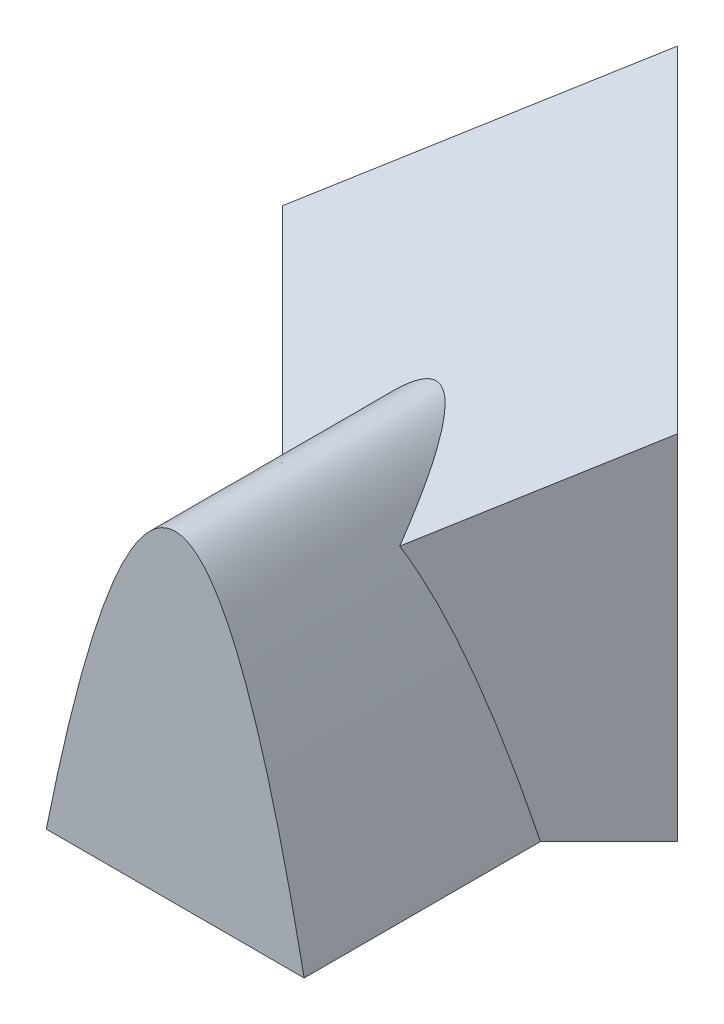
ISO-10303-21;
HEADER;
FILE_DESCRIPTION(('STEP AP214'),'2;1');
FILE_NAME('part.step','',(''),(''),'','','');
FILE_SCHEMA(('AUTOMOTIVE_DESIGN { 1 0 10303 214 1 1 1 1 }'));
ENDSEC;
DATA;
#1=APPLICATION_CONTEXT('core data for automotive mechanical design processes');
#2=APPLICATION_PROTOCOL_DEFINITION('international standard','automotive_design',2000,#1);
#3=PRODUCT_CONTEXT('',#1,'mechanical');
#4=PRODUCT('Part','Part','',(#3));
#5=PRODUCT_RELATED_PRODUCT_CATEGORY('part','',(#4));
#6=PRODUCT_DEFINITION_FORMATION('','',#4);
#7=PRODUCT_DEFINITION_CONTEXT('part definition',#1,'design');
#8=PRODUCT_DEFINITION('design','',#6,#7);
#9=PRODUCT_DEFINITION_SHAPE('','',#8);
#10=(LENGTH_UNIT() NAMED_UNIT(*) SI_UNIT(.MILLI.,.METRE.));
#11=(NAMED_UNIT(*) PLANE_ANGLE_UNIT() SI_UNIT($,.RADIAN.));
#12=(NAMED_UNIT(*) SI_UNIT($,.STERADIAN.) SOLID_ANGLE_UNIT());
#13=UNCERTAINTY_MEASURE_WITH_UNIT(LENGTH_MEASURE(1.E-05),#10,'distance_accuracy_value','');
#14=(GEOMETRIC_REPRESENTATION_CONTEXT(3) GLOBAL_UNCERTAINTY_ASSIGNED_CONTEXT((#13)) GLOBAL_UNIT_ASSIGNED_CONTEXT((#10,
#11,#12)) REPRESENTATION_CONTEXT('',''));
#15=CARTESIAN_POINT('',(0.,0.,0.));
#16=DIRECTION('',(0.,0.,1.));
#17=DIRECTION('',(1.,0.,0.));
#18=AXIS2_PLACEMENT_3D('',#15,#16,#17);
#19=CARTESIAN_POINT('',(-91.9238815542511,228.73,-91.923881554251));
#20=DIRECTION('',(0.707106781186547,0.,-0.707106781186548));
#21=DIRECTION('',(-0.707106781186548,0.,-0.707106781186547));
#22=AXIS2_PLACEMENT_3D('',#19,#20,#21);
#23=PLANE('',#22);
#24=CARTESIAN_POINT('',(0.,149.999999999999,0.));
#25=CARTESIAN_POINT('',(-0.165044397724254,150.00000226675,-0.165044397724277));
#26=CARTESIAN_POINT('',(-0.3300791985032,149.996594514592,-0.330079198503224));
#27=CARTESIAN_POINT('',(-0.660006230604019,149.982983211314,-0.660006230604038));
#28=CARTESIAN_POINT('',(-0.824898464007725,149.972779761165,-0.824898464007736));
#29=CARTESIAN_POINT('',(-1.31877503875476,149.932045767023,-1.31877503875476));
#30=CARTESIAN_POINT('',(-1.64736912373413,149.891391444173,-1.64736912373415));
#31=CARTESIAN_POINT('',(-2.30222237683846,149.783623701056,-2.30222237683848));
#32=CARTESIAN_POINT('',(-2.6284824121547,149.716520689574,-2.62848241215471));
#33=CARTESIAN_POINT('',(-3.27412193371417,149.557630888755,-3.27412193371419));
#34=CARTESIAN_POINT('',(-3.59353741763548,149.466136013798,-3.59353741763553));
#35=CARTESIAN_POINT('',(-4.22854205004932,149.259178003124,-4.22854205004929));
#36=CARTESIAN_POINT('',(-4.54413014918476,149.143708444757,-4.54413014918464));
#37=CARTESIAN_POINT('',(-5.17074433360511,148.890066842603,-5.17074433360526));
#38=CARTESIAN_POINT('',(-5.48176966980733,148.751891115521,-5.48176966980783));
#39=CARTESIAN_POINT('',(-6.21059264118733,148.40021635024,-6.21059264118799));
#40=CARTESIAN_POINT('',(-6.62619441534027,148.177576081691,-6.62619441534046));
#41=CARTESIAN_POINT('',(-7.44692804828146,147.696324422114,-7.44692804828131));
#42=CARTESIAN_POINT('',(-7.85205664496993,147.437701979983,-7.8520566449699));
#43=CARTESIAN_POINT('',(-8.65121217995856,146.888175480307,-8.65121217995861));
#44=CARTESIAN_POINT('',(-9.04523831710861,146.597269100606,-9.04523831710863));
#45=CARTESIAN_POINT('',(-9.82391095697862,145.98513110308,-9.82391095697863));
#46=CARTESIAN_POINT('',(-10.2084996222596,145.66375289837,-10.2084996222596));
#47=CARTESIAN_POINT('',(-10.9662076835292,144.995242320632,-10.9662076835292));
#48=CARTESIAN_POINT('',(-11.3393287299782,144.64811367848,-11.3393287299781));
#49=CARTESIAN_POINT('',(-12.074401398971,143.930995518285,-12.0744013989712));
#50=CARTESIAN_POINT('',(-12.4363523651466,143.561004660651,-12.4363523651472));
#51=CARTESIAN_POINT('',(-13.4388438581542,142.492291607155,-13.4388438581552));
#52=CARTESIAN_POINT('',(-14.0671085577557,141.770450329765,-14.067108557756));
#53=CARTESIAN_POINT('',(-15.2912248761143,140.2730550488,-15.2912248761141));
#54=CARTESIAN_POINT('',(-15.8870525787552,139.497462346378,-15.8870525787551));
#55=CARTESIAN_POINT('',(-17.0490835376224,137.902765522724,-17.0490835376225));
#56=CARTESIAN_POINT('',(-17.6152773239716,137.083647658991,-17.6152773239716));
#57=CARTESIAN_POINT('',(-18.721907572817,135.408206403994,-18.721907572817));
#58=CARTESIAN_POINT('',(-19.2622864055054,134.551807244365,-19.2622864055054));
#59=CARTESIAN_POINT('',(-20.3184409387694,132.809984901682,-20.3184409387694));
#60=CARTESIAN_POINT('',(-20.8342279947726,131.924575439341,-20.8342279947727));
#61=CARTESIAN_POINT('',(-21.8437923161419,130.129311693067,-21.8437923161418));
#62=CARTESIAN_POINT('',(-22.337573165806,129.219461428948,-22.3375731658056));
#63=CARTESIAN_POINT('',(-23.2316262179595,127.519153853418,-23.2316262179592));
#64=CARTESIAN_POINT('',(-23.6346862763096,126.73161757179,-23.6346862763095));
#65=CARTESIAN_POINT('',(-24.4277346058467,125.143459489628,-24.4277346058467));
#66=CARTESIAN_POINT('',(-24.8177223845516,124.342837197782,-24.8177223845516));
#67=CARTESIAN_POINT('',(-25.5858211012439,122.729721220874,-25.5858211012439));
#68=CARTESIAN_POINT('',(-25.9639260744184,121.917221864481,-25.9639260744184));
#69=CARTESIAN_POINT('',(-26.7089690563745,120.282072271783,-26.7089690563745));
#70=CARTESIAN_POINT('',(-27.0759071901193,119.459422149215,-27.0759071901193));
#71=CARTESIAN_POINT('',(-27.7998533098541,117.804138469623,-27.7998533098541));
#72=CARTESIAN_POINT('',(-28.1568494617812,116.971494572885,-28.1568494617812));
#73=CARTESIAN_POINT('',(-28.8612110297696,115.298104964206,-28.8612110297696));
#74=CARTESIAN_POINT('',(-29.2085764214566,114.457359231767,-29.2085764214566));
#75=CARTESIAN_POINT('',(-29.8946977429593,112.767702918137,-29.8946977429593));
#76=CARTESIAN_POINT('',(-30.2334442586993,111.918784696827,-30.2334442586993));
#77=CARTESIAN_POINT('',(-30.9025460875436,110.214354561116,-30.9025460875436));
#78=CARTESIAN_POINT('',(-31.2329012800651,109.358842552191,-31.232901280065));
#79=CARTESIAN_POINT('',(-32.2125487144884,106.782451016629,-32.2125487144884));
#80=CARTESIAN_POINT('',(-32.8500670436848,105.052596310057,-32.8500670436848));
#81=CARTESIAN_POINT('',(-34.0972717742097,101.573525051152,-34.0972717742097));
#82=CARTESIAN_POINT('',(-34.7069646284785,99.8243131060277,-34.7069646284785));
#83=CARTESIAN_POINT('',(-35.9058915793557,96.2970317878589,-35.9058915793557));
#84=CARTESIAN_POINT('',(-36.494954879161,94.5188464806628,-36.494954879161));
#85=CARTESIAN_POINT('',(-37.650193840534,90.9498393902838,-37.650193840534));
#86=CARTESIAN_POINT('',(-38.2163917208144,89.1590319622239,-38.2163917208144));
#87=CARTESIAN_POINT('',(-39.3283738730086,85.5661623956086,-39.3283738730086));
#88=CARTESIAN_POINT('',(-39.874170907024,83.7641081449704,-39.874170907024));
#89=CARTESIAN_POINT('',(-40.9474116668411,80.1498874866703,-40.9474116668411));
#90=CARTESIAN_POINT('',(-41.474861994448,78.3377249944743,-41.4748619944479));
#91=CARTESIAN_POINT('',(-42.5131474169177,74.7042390707664,-42.5131474169176));
#92=CARTESIAN_POINT('',(-43.0239850441514,72.8829170848271,-43.0239850441514));
#93=CARTESIAN_POINT('',(-44.0305276528641,69.2319124794388,-44.030527652864));
#94=CARTESIAN_POINT('',(-44.5262324514209,67.4022297592343,-44.5262324514208));
#95=CARTESIAN_POINT('',(-45.4969976718372,63.7606469890181,-45.4969976718371));
#96=CARTESIAN_POINT('',(-45.9722482012721,61.9488481967463,-45.972248201272));
#97=CARTESIAN_POINT('',(-46.9102963870958,58.3185041113937,-46.9102963870957));
#98=CARTESIAN_POINT('',(-47.3730921186779,56.499957824387,-47.3730921186778));
#99=CARTESIAN_POINT('',(-48.2871296521887,52.8567498995636,-48.2871296521887));
#100=CARTESIAN_POINT('',(-48.7383696277169,51.0320873459759,-48.7383696277169));
#101=CARTESIAN_POINT('',(-49.6300857325722,47.377224946361,-49.6300857325722));
#102=CARTESIAN_POINT('',(-50.0705603347349,45.5470243556252,-50.0705603347348));
#103=CARTESIAN_POINT('',(-50.9414443452417,41.8816196138174,-50.9414443452417));
#104=CARTESIAN_POINT('',(-51.3718526449532,40.0464149362509,-51.3718526449531));
#105=CARTESIAN_POINT('',(-52.2232253195073,36.3714980124519,-52.2232253195073));
#106=CARTESIAN_POINT('',(-52.644189069862,34.5317854770221,-52.6441890698619));
#107=CARTESIAN_POINT('',(-53.4693305198852,30.883235832699,-53.4693305198852));
#108=CARTESIAN_POINT('',(-53.8736751440163,29.0744741835962,-53.8736751440163));
#109=CARTESIAN_POINT('',(-54.6742800411597,25.4534721730244,-54.6742800411597));
#110=CARTESIAN_POINT('',(-55.0705406983985,23.6412319813889,-55.0705406983985));
#111=CARTESIAN_POINT('',(-55.8554003930864,20.0136762055081,-55.8554003930864));
#112=CARTESIAN_POINT('',(-56.244000346152,18.1983610173009,-56.244000346152));
#113=CARTESIAN_POINT('',(-57.0139207703733,14.565041157185,-57.0139207703733));
#114=CARTESIAN_POINT('',(-57.3952426767348,12.7470370933192,-57.3952426767347));
#115=CARTESIAN_POINT('',(-58.1509560681481,9.10871198158162,-58.150956068148));
#116=CARTESIAN_POINT('',(-58.5253494886099,7.28839173733181,-58.5253494886098));
#117=CARTESIAN_POINT('',(-59.2675167756222,3.6457886253557,-59.2675167756222));
#118=CARTESIAN_POINT('',(-59.6352930571099,1.82350674186466,-59.6352930571098));
#119=CARTESIAN_POINT('',(-60.0000000000008,-3.5527136788005E-12,-60.0000000000008));
#120=B_SPLINE_CURVE_WITH_KNOTS('',3,(#24,#25,#26,#27,#28,#29,#30,#31,#32,#33,#34,#35,#36,#37,
#38,#39,#40,#41,#42,#43,#44,#45,#46,#47,#48,#49,#50,#51,#52,#53,#54,#55,#56,#57,#58,#59,#60,#61,
#62,#63,#64,#65,#66,#67,#68,#69,#70,#71,#72,#73,#74,#75,#76,#77,#78,#79,#80,#81,#82,#83,#84,#85,
#86,#87,#88,#89,#90,#91,#92,#93,#94,#95,#96,#97,#98,#99,#100,#101,#102,#103,#104,#105,#106,#107,
#108,#109,#110,#111,#112,#113,#114,#115,#116,#117,#118,#119),.UNSPECIFIED.,.F.,.F.,(4,2,2,2,2,2,
2,2,2,2,2,2,2,2,2,2,2,2,2,2,2,2,2,2,2,2,2,2,2,2,2,2,2,2,2,2,2,2,2,2,2,2,2,2,2,2,2,4),(0.,
0.700172317024935,1.40033423105061,2.79892180107726,4.19695951067093,5.57896368345406,
6.96133856436382,8.34393790987953,10.2280803622665,12.112802768697,13.997660829627,
15.8920968565979,17.7862589405325,19.6805321167539,23.1119765212354,26.5459176193595,
29.9809494575773,33.4233220478799,36.864089390599,40.3042942489185,43.220548585317,
46.1369126647947,49.0547180185623,51.9724907084518,54.8935996366776,57.8147159572343,
60.7388966880357,63.66311941543,69.5146057884688,75.364728188977,81.2553387413799,
87.1400803507347,93.0210768525012,98.8999347948716,104.777892347497,110.65592092341,
116.453154606749,122.251279128409,128.050314464129,133.85016772528,139.650656762485,
145.451528213193,151.142487522851,156.833175711249,162.523179566829,168.212049532106,
173.899305615502,179.584442206956),.UNSPECIFIED.);
#121=CARTESIAN_POINT('',(-27.243012005405,119.075762369722,-27.2430120054049));
#122=VERTEX_POINT('',#121);
#123=CARTESIAN_POINT('',(-60.0000000000002,-4.44089209850063E-13,-60.0000000000001));
#124=VERTEX_POINT('',#123);
#125=EDGE_CURVE('E113',#122,#124,#120,.T.);
#126=ORIENTED_EDGE('',*,*,#125,.F.);
#127=DIRECTION('',(-0.633687274224644,0.443712606279654,-0.633687274224643));
#128=VECTOR('',#127,1.);
#129=CARTESIAN_POINT('',(-110.021489010192,177.037875969992,-110.021489010192));
#130=LINE('',#129,#128);
#131=CARTESIAN_POINT('',(-91.9238815542511,164.365794805782,-91.923881554251));
#132=VERTEX_POINT('',#131);
#133=EDGE_CURVE('E163',#122,#132,#130,.T.);
#134=ORIENTED_EDGE('',*,*,#133,.T.);
#135=DIRECTION('',(0.,-1.,0.));
#136=VECTOR('',#135,1.);
#137=CARTESIAN_POINT('',(-91.9238815542511,228.73,-91.923881554251));
#138=LINE('',#137,#136);
#139=CARTESIAN_POINT('',(-91.9238815542511,0.,-91.923881554251));
#140=VERTEX_POINT('',#139);
#141=EDGE_CURVE('E189',#132,#140,#138,.T.);
#142=ORIENTED_EDGE('',*,*,#141,.T.);
#143=DIRECTION('',(0.707106781186548,0.,0.707106781186547));
#144=VECTOR('',#143,1.);
#145=CARTESIAN_POINT('',(-91.9238815542511,0.,-91.923881554251));
#146=LINE('',#145,#144);
#147=EDGE_CURVE('E60',#140,#124,#146,.T.);
#148=ORIENTED_EDGE('',*,*,#147,.T.);
#149=EDGE_LOOP('',(#126,#134,#142,#148));
#150=FACE_BOUND('',#149,.T.);
#151=ADVANCED_FACE('F32',(#150),#23,.F.);
#152=CARTESIAN_POINT('',(0.,228.73,0.));
#153=DIRECTION('',(-0.707106781186548,0.,-0.707106781186548));
#154=DIRECTION('',(-0.707106781186548,0.,0.707106781186548));
#155=AXIS2_PLACEMENT_3D('',#152,#153,#154);
#156=PLANE('',#155);
#157=CARTESIAN_POINT('',(60.,-4.9960036108132E-13,-59.9999999999999));
#158=CARTESIAN_POINT('',(59.6673666832738,1.66315354379552,-59.6673666832737));
#159=CARTESIAN_POINT('',(59.332177667115,3.32528330222155,-59.332177667115));
#160=CARTESIAN_POINT('',(58.6564354750826,6.64736604737815,-58.6564354750826));
#161=CARTESIAN_POINT('',(58.3158822820104,8.30731902711105,-58.3158822820104));
#162=CARTESIAN_POINT('',(57.2811314216983,13.3062596720597,-57.2811314216983));
#163=CARTESIAN_POINT('',(56.5783583473666,16.6417091566335,-56.5783583473666));
#164=CARTESIAN_POINT('',(55.1439612211376,23.3191934403863,-55.1439612211376));
#165=CARTESIAN_POINT('',(54.4122058194094,26.6611718641113,-54.4122058194094));
#166=CARTESIAN_POINT('',(52.9177133466045,33.3448377150514,-52.9177133466045));
#167=CARTESIAN_POINT('',(52.1548718573239,36.6864785057135,-52.1548718573239));
#168=CARTESIAN_POINT('',(50.5955741515017,43.3623933609874,-50.5955741515018));
#169=CARTESIAN_POINT('',(49.7990464242203,46.6966341264961,-49.7990464242203));
#170=CARTESIAN_POINT('',(48.5767293177402,51.686136100469,-48.5767293177402));
#171=CARTESIAN_POINT('',(48.1645137748041,53.3480612838114,-48.1645137748041));
#172=CARTESIAN_POINT('',(47.3303837470415,56.6670334514192,-47.3303837470415));
#173=CARTESIAN_POINT('',(46.9084693086571,58.3240804590005,-46.9084693086571));
#174=CARTESIAN_POINT('',(46.040317230325,61.6868211029122,-46.040317230325));
#175=CARTESIAN_POINT('',(45.5937351850263,63.3923370289028,-45.5937351850264));
#176=CARTESIAN_POINT('',(44.6886547341056,66.7970394396247,-44.6886547341056));
#177=CARTESIAN_POINT('',(44.2301563224859,68.4962259211701,-44.2301563224859));
#178=CARTESIAN_POINT('',(43.3007597176072,71.8858311075393,-43.3007597176072));
#179=CARTESIAN_POINT('',(42.8298745431522,73.5762569454042,-42.8298745431522));
#180=CARTESIAN_POINT('',(41.8741800614144,76.9492250034708,-41.8741800614144));
#181=CARTESIAN_POINT('',(41.3893707606113,78.6317672273409,-41.3893707606113));
#182=CARTESIAN_POINT('',(40.4054316209641,81.98511410576,-40.4054316209641));
#183=CARTESIAN_POINT('',(39.9063275238822,83.6559338500278,-39.9063275238822));
#184=CARTESIAN_POINT('',(38.8916022240292,86.9875300550338,-38.8916022240292));
#185=CARTESIAN_POINT('',(38.3759809750455,88.6483064876568,-38.3759809750456));
#186=CARTESIAN_POINT('',(37.3276721260673,91.9549624327122,-37.3276721260674));
#187=CARTESIAN_POINT('',(36.7950218478639,93.6008655754807,-36.7950218478639));
#188=CARTESIAN_POINT('',(35.7097648395427,96.8794658289634,-35.7097648395427));
#189=CARTESIAN_POINT('',(35.15715826377,98.5121630416947,-35.15715826377));
#190=CARTESIAN_POINT('',(34.030794713392,101.759236201149,-34.030794713392));
#191=CARTESIAN_POINT('',(33.4570781829934,103.373640148523,-33.4570781829934));
#192=CARTESIAN_POINT('',(32.284914966555,106.584491866621,-32.284914966555));
#193=CARTESIAN_POINT('',(31.6864674295621,108.180939017072,-31.6864674295621));
#194=CARTESIAN_POINT('',(30.4619006210869,111.351984910791,-30.4619006210869));
#195=CARTESIAN_POINT('',(29.8357891045895,112.926589616506,-29.8357891045895));
#196=CARTESIAN_POINT('',(28.8729711246861,115.268929727467,-28.8729711246861));
#197=CARTESIAN_POINT('',(28.5481019991068,116.046421278377,-28.5481019991068));
#198=CARTESIAN_POINT('',(27.8899139462517,117.594211141393,-27.8899139462517));
#199=CARTESIAN_POINT('',(27.5565951890455,118.364509597852,-27.5565951890455));
#200=CARTESIAN_POINT('',(26.935077990114,119.77425078327,-26.935077990114));
#201=CARTESIAN_POINT('',(26.6482144962846,120.414870863487,-26.6482144962846));
#202=CARTESIAN_POINT('',(26.0676575715416,121.690063139298,-26.0676575715416));
#203=CARTESIAN_POINT('',(25.7739629015327,122.324634207774,-25.7739629015327));
#204=CARTESIAN_POINT('',(25.179338206654,123.587055504297,-25.179338206654));
#205=CARTESIAN_POINT('',(24.8784074719896,124.214905064221,-24.8784074719896));
#206=CARTESIAN_POINT('',(24.2688494222749,125.463160347639,-24.2688494222749));
#207=CARTESIAN_POINT('',(23.9602215572537,126.083565534506,-23.9602215572537));
#208=CARTESIAN_POINT('',(23.3340849781253,127.317446337156,-23.3340849781253));
#209=CARTESIAN_POINT('',(23.0165580530954,127.930903490434,-23.0165580530954));
#210=CARTESIAN_POINT('',(22.3727224950512,129.148538412077,-22.3727224950511));
#211=CARTESIAN_POINT('',(22.0464138847685,129.752716204455,-22.0464138847685));
#212=CARTESIAN_POINT('',(21.3844212546617,130.950670443273,-21.3844212546617));
#213=CARTESIAN_POINT('',(21.0487377826852,131.544447494224,-21.0487377826853));
#214=CARTESIAN_POINT('',(20.3673121716104,132.720360967917,-20.3673121716103));
#215=CARTESIAN_POINT('',(20.0215699059982,133.302497244092,-20.021569905998));
#216=CARTESIAN_POINT('',(19.1966238904391,134.654760983436,-19.1966238904388));
#217=CARTESIAN_POINT('',(18.7129925651955,135.419514211421,-18.7129925651954));
#218=CARTESIAN_POINT('',(17.7241503401202,136.920790307295,-17.7241503401203));
#219=CARTESIAN_POINT('',(17.2189377350047,137.657310935577,-17.2189377350047));
#220=CARTESIAN_POINT('',(16.1845957735109,139.096938007537,-16.1845957735109));
#221=CARTESIAN_POINT('',(15.6554533456525,139.800025747913,-15.6554533456525));
#222=CARTESIAN_POINT('',(14.5735190399513,141.162666613646,-14.5735190399513));
#223=CARTESIAN_POINT('',(14.0208306950432,141.822383265125,-14.0208306950433));
#224=CARTESIAN_POINT('',(12.8880456386683,143.092457869815,-12.8880456386682));
#225=CARTESIAN_POINT('',(12.3079607575682,143.702836824797,-12.307960757568));
#226=CARTESIAN_POINT('',(11.1189592510804,144.863401084873,-11.1189592510806));
#227=CARTESIAN_POINT('',(10.5100726440921,145.413647165217,-10.5100726440929));
#228=CARTESIAN_POINT('',(9.56569994936906,146.191672275825,-9.56569994936957));
#229=CARTESIAN_POINT('',(9.2411599947035,146.446202899068,-9.24115999470363));
#230=CARTESIAN_POINT('',(8.58421552698227,146.934130174077,-8.58421552698213));
#231=CARTESIAN_POINT('',(8.25181145510165,147.167528007857,-8.25181145510162));
#232=CARTESIAN_POINT('',(7.57929347054589,147.611141092827,-7.57929347054592));
#233=CARTESIAN_POINT('',(7.23917867998781,147.821353688183,-7.23917867998782));
#234=CARTESIAN_POINT('',(6.55265517265616,148.215840481068,-6.55265517265615));
#235=CARTESIAN_POINT('',(6.20626803689666,148.400189528365,-6.20626803689667));
#236=CARTESIAN_POINT('',(5.50683425434872,148.741544528209,-5.50683425434872));
#237=CARTESIAN_POINT('',(5.15378809765994,148.898552484405,-5.1537880976599));
#238=CARTESIAN_POINT('',(4.44193505411306,149.18315787527,-4.4419350541131));
#239=CARTESIAN_POINT('',(4.08313071025703,149.310767930376,-4.08313071025717));
#240=CARTESIAN_POINT('',(3.51871813056608,149.485831765,-3.51871813056617));
#241=CARTESIAN_POINT('',(3.31473599646544,149.543934037206,-3.31473599646546));
#242=CARTESIAN_POINT('',(2.90548531369595,149.650000272317,-2.90548531369593));
#243=CARTESIAN_POINT('',(2.70021698826559,149.697965947001,-2.70021698826558));
#244=CARTESIAN_POINT('',(2.28862754341918,149.783522182949,-2.28862754341918));
#245=CARTESIAN_POINT('',(2.08230655268513,149.821113982808,-2.08230655268513));
#246=CARTESIAN_POINT('',(1.66805874097948,149.885860200365,-1.66805874097948));
#247=CARTESIAN_POINT('',(1.46012879855617,149.912974757863,-1.46012879855617));
#248=CARTESIAN_POINT('',(1.04367662551249,149.956420208679,-1.04367662551249));
#249=CARTESIAN_POINT('',(0.83515431663229,149.97274960357,-0.835154316632293));
#250=CARTESIAN_POINT('',(0.417755282050337,149.994546596167,-0.417755282050334));
#251=CARTESIAN_POINT('',(0.208878459926381,150.000010497662,-0.208878459926371));
#252=CARTESIAN_POINT('',(0.,149.999999999999,0.));
#253=B_SPLINE_CURVE_WITH_KNOTS('',3,(#157,#158,#159,#160,#161,#162,#163,#164,#165,#166,#167,
#168,#169,#170,#171,#172,#173,#174,#175,#176,#177,#178,#179,#180,#181,#182,#183,#184,#185,#186,
#187,#188,#189,#190,#191,#192,#193,#194,#195,#196,#197,#198,#199,#200,#201,#202,#203,#204,#205,
#206,#207,#208,#209,#210,#211,#212,#213,#214,#215,#216,#217,#218,#219,#220,#221,#222,#223,#224,
#225,#226,#227,#228,#229,#230,#231,#232,#233,#234,#235,#236,#237,#238,#239,#240,#241,#242,#243,
#244,#245,#246,#247,#248,#249,#250,#251,#252),.UNSPECIFIED.,.F.,.F.,(4,2,2,2,2,2,2,2,2,2,2,2,2,
2,2,2,2,2,2,2,2,2,2,2,2,2,2,2,2,2,2,2,2,2,2,2,2,2,2,2,2,2,2,2,2,2,2,4),(0.,5.18519465096439,
10.3704059300745,20.8113381728451,31.3067221853466,41.8408585773231,52.3986058720298,
57.6821678560166,62.9657045454808,68.4217108537067,73.877719908042,79.3282072124852,
84.7786919805516,90.2199123755823,95.6611479957088,101.091181186983,106.521172390553,
111.941252874926,117.361520010844,122.780277217208,125.489462949571,128.198594196159,
130.473331256394,132.748484195591,135.023861225186,137.299401302126,139.579998071356,
141.860588937754,144.141046808842,146.421533374624,149.498727610559,152.576165447971,
155.655305110522,158.722076454079,161.787535401839,164.849866917627,166.423884117839,
167.997813224481,169.571922435504,171.141377770943,172.710718042759,174.279383340438,
175.162030849901,176.044529186416,176.926922110975,177.812639762308,178.698480444187,
179.58462241881),.UNSPECIFIED.);
#254=CARTESIAN_POINT('',(60.0000000000012,-2.88657986402541E-12,-60.0000000000012));
#255=VERTEX_POINT('',#254);
#256=CARTESIAN_POINT('',(27.243012005404,119.075762369721,-27.243012005404));
#257=VERTEX_POINT('',#256);
#258=EDGE_CURVE('E52',#255,#257,#253,.T.);
#259=ORIENTED_EDGE('',*,*,#258,.F.);
#260=DIRECTION('',(0.707106781186547,0.,-0.707106781186547));
#261=VECTOR('',#260,1.);
#262=CARTESIAN_POINT('',(0.,0.,0.));
#263=LINE('',#262,#261);
#264=CARTESIAN_POINT('',(91.9238815542512,0.,-91.9238815542512));
#265=VERTEX_POINT('',#264);
#266=EDGE_CURVE('E177',#255,#265,#263,.T.);
#267=ORIENTED_EDGE('',*,*,#266,.T.);
#268=DIRECTION('',(0.,-1.,0.));
#269=VECTOR('',#268,1.);
#270=CARTESIAN_POINT('',(91.9238815542512,228.73,-91.9238815542512));
#271=LINE('',#270,#269);
#272=CARTESIAN_POINT('',(91.9238815542512,164.365794805782,-91.9238815542512));
#273=VERTEX_POINT('',#272);
#274=EDGE_CURVE('E170',#273,#265,#271,.T.);
#275=ORIENTED_EDGE('',*,*,#274,.F.);
#276=DIRECTION('',(-0.633687274224643,-0.443712606279654,0.633687274224643));
#277=VECTOR('',#276,1.);
#278=CARTESIAN_POINT('',(36.1956618709648,125.344475292539,-36.1956618709648));
#279=LINE('',#278,#277);
#280=EDGE_CURVE('E166',#273,#257,#279,.T.);
#281=ORIENTED_EDGE('',*,*,#280,.T.);
#282=EDGE_LOOP('',(#259,#267,#275,#281));
#283=FACE_BOUND('',#282,.T.);
#284=ADVANCED_FACE('F125',(#283),#156,.F.);
#285=CARTESIAN_POINT('',(-95.,100.,0.));
#286=DIRECTION('',(0.,-0.819152044288995,-0.573576436351042));
#287=DIRECTION('',(0.,0.573576436351042,-0.819152044288995));
#288=AXIS2_PLACEMENT_3D('',#285,#286,#287);
#289=PLANE('',#288);
#290=CARTESIAN_POINT('',(34.641016151377,100.,0.));
#291=CARTESIAN_POINT('',(34.2891955003922,101.015531791488,-1.45032970379645));
#292=CARTESIAN_POINT('',(33.9322739079198,102.030486697382,-2.89983552958233));
#293=CARTESIAN_POINT('',(33.2061151792739,104.061944865384,-5.80105846299479));
#294=CARTESIAN_POINT('',(32.8368459878707,105.07844435585,-7.252770184158));
#295=CARTESIAN_POINT('',(32.0850366593921,107.112163012221,-10.1572214295285));
#296=CARTESIAN_POINT('',(31.7024691541755,108.129378854648,-11.6099562073179));
#297=CARTESIAN_POINT('',(30.9228746315737,110.16366940123,-14.5152241965526));
#298=CARTESIAN_POINT('',(30.5258257693864,111.18074135469,-15.9677534796002));
#299=CARTESIAN_POINT('',(29.7158488921146,113.213855190755,-18.8713409520559));
#300=CARTESIAN_POINT('',(29.3029056929787,114.229895086332,-20.3223963036944));
#301=CARTESIAN_POINT('',(28.459402671168,116.260016007531,-23.2217094507501));
#302=CARTESIAN_POINT('',(28.0288356113501,117.274096045662,-24.6699658358844));
#303=CARTESIAN_POINT('',(27.1166226338961,119.371308635649,-27.6650958159886));
#304=CARTESIAN_POINT('',(26.6335204308916,120.454233242792,-29.2116724351315));
#305=CARTESIAN_POINT('',(25.6411852556365,122.615665615432,-32.2985177698261));
#306=CARTESIAN_POINT('',(25.1319634317974,123.694175056629,-33.838788878524));
#307=CARTESIAN_POINT('',(24.3450456226192,125.30780305755,-36.1432884916631));
#308=CARTESIAN_POINT('',(24.0789939747387,125.844793515206,-36.9101903434039));
#309=CARTESIAN_POINT('',(23.5384016777178,126.917365469716,-38.441981842325));
#310=CARTESIAN_POINT('',(23.263861084862,127.452946975887,-39.2068715028103));
#311=CARTESIAN_POINT('',(22.7057143660251,128.522014127069,-40.733657623844));
#312=CARTESIAN_POINT('',(22.4221168830598,129.055501255088,-41.4955562023473));
#313=CARTESIAN_POINT('',(21.8446331561468,130.120641265051,-43.0167337844776));
#314=CARTESIAN_POINT('',(21.5507469425926,130.652294152409,-43.7760127958357));
#315=CARTESIAN_POINT('',(20.95178676059,131.713010615402,-45.2908728981788));
#316=CARTESIAN_POINT('',(20.6467228313233,132.242076053165,-46.0464566485565));
#317=CARTESIAN_POINT('',(20.0237735527592,133.297730694187,-47.5540877199401));
#318=CARTESIAN_POINT('',(19.7058880330871,133.824319864437,-48.3061349938046));
#319=CARTESIAN_POINT('',(19.0557131975885,134.874394094636,-49.8057964125945));
#320=CARTESIAN_POINT('',(18.7234281760232,135.397880027817,-50.5534118046233));
#321=CARTESIAN_POINT('',(18.0423151526756,136.441289086377,-52.0435543718226));
#322=CARTESIAN_POINT('',(17.693487849189,136.961212361088,-52.7860817602603));
#323=CARTESIAN_POINT('',(17.1256834003788,137.781446906685,-53.9574980916154));
#324=CARTESIAN_POINT('',(16.9130133706315,138.08319653368,-54.3884412199434));
#325=CARTESIAN_POINT('',(16.480467066438,138.685042306087,-55.2479660601732));
#326=CARTESIAN_POINT('',(16.2605898296408,138.985138224385,-55.6765474477226));
#327=CARTESIAN_POINT('',(15.8128801522089,139.583456011572,-56.5310338028909));
#328=CARTESIAN_POINT('',(15.5850458874359,139.881677431997,-56.9569381300392));
#329=CARTESIAN_POINT('',(15.1205230557517,140.475989982405,-57.8057044142868));
#330=CARTESIAN_POINT('',(14.8838309860127,140.772080213223,-58.2285650872452));
#331=CARTESIAN_POINT('',(14.4005066451985,141.361827485593,-59.0708114787614));
#332=CARTESIAN_POINT('',(14.1538678077799,141.655482760269,-59.4901946739598));
#333=CARTESIAN_POINT('',(13.6512144182713,142.237796507706,-60.3218248916598));
#334=CARTESIAN_POINT('',(13.3952704480298,142.526474978339,-60.7341004740836));
#335=CARTESIAN_POINT('',(12.8710764804158,143.100171251613,-61.5534236632351));
#336=CARTESIAN_POINT('',(12.6028255289902,143.385188768252,-61.9604708615103));
#337=CARTESIAN_POINT('',(12.0524519765079,143.950588130047,-62.7679448330715));
#338=CARTESIAN_POINT('',(11.7703372821219,144.230972498367,-63.1683752098107));
#339=CARTESIAN_POINT('',(11.1902047226749,144.78597564444,-63.961001846607));
#340=CARTESIAN_POINT('',(10.8922004339581,145.060599073469,-64.3532047493751));
#341=CARTESIAN_POINT('',(10.2775754039981,145.602746570487,-65.127471616613));
#342=CARTESIAN_POINT('',(9.96096448497943,145.870274277875,-65.5095407786825));
#343=CARTESIAN_POINT('',(9.34429488645471,146.365318695417,-66.2165374768421));
#344=CARTESIAN_POINT('',(9.04668282872028,146.593835104837,-66.5428927314487));
#345=CARTESIAN_POINT('',(8.43132095312893,147.041985392875,-67.1829176720221));
#346=CARTESIAN_POINT('',(8.11356480886559,147.261616445147,-67.4965833215473));
#347=CARTESIAN_POINT('',(7.6198531553819,147.581863516398,-67.9539435380202));
#348=CARTESIAN_POINT('',(7.45267299295821,147.686943910389,-68.1040138932462));
#349=CARTESIAN_POINT('',(7.11201060606227,147.893680915772,-68.399264935404));
#350=CARTESIAN_POINT('',(6.93852904706352,147.99533788653,-68.5444461355635));
#351=CARTESIAN_POINT('',(6.58484771452923,148.194626300522,-68.8290594867724));
#352=CARTESIAN_POINT('',(6.40465176603892,148.292259970948,-68.9684948185821));
#353=CARTESIAN_POINT('',(6.03695667458265,148.482872933456,-69.2407183410475));
#354=CARTESIAN_POINT('',(5.8494587593417,148.575853002022,-69.3735076406355));
#355=CARTESIAN_POINT('',(5.4603538352116,148.759317382195,-69.6355219294885));
#356=CARTESIAN_POINT('',(5.25848591417689,148.84962049966,-69.7644881466996));
#357=CARTESIAN_POINT('',(4.84588274660393,149.023332291326,-70.0125742957147));
#358=CARTESIAN_POINT('',(4.63514757215351,149.10674102156,-70.1316943075418));
#359=CARTESIAN_POINT('',(4.20452236495748,149.265347216129,-70.3582074281755));
#360=CARTESIAN_POINT('',(3.98463508591554,149.340547126031,-70.4656040296135));
#361=CARTESIAN_POINT('',(3.53559006775486,149.481248991685,-70.6665471185805));
#362=CARTESIAN_POINT('',(3.30643396124912,149.546752645948,-70.7600960318338));
#363=CARTESIAN_POINT('',(2.87847063873872,149.656340992269,-70.9166044101978));
#364=CARTESIAN_POINT('',(2.68102788792949,149.702175352725,-70.9820626607366));
#365=CARTESIAN_POINT('',(2.28054029381417,149.784967171905,-71.1003016322839));
#366=CARTESIAN_POINT('',(2.07749595754912,149.821925431152,-71.1530834965557));
#367=CARTESIAN_POINT('',(1.66699795693689,149.885965515618,-71.244542215535));
#368=CARTESIAN_POINT('',(1.45955083078114,149.913061030924,-71.2832386217122));
#369=CARTESIAN_POINT('',(1.04127276158377,149.956644830739,-71.3454827385442));
#370=CARTESIAN_POINT('',(0.83044186859909,149.973133272012,-71.3690306730831));
#371=CARTESIAN_POINT('',(0.405811444074676,149.995026708935,-71.4002977413851));
#372=CARTESIAN_POINT('',(0.192001845051521,150.000368070033,-71.4079259955912));
#373=CARTESIAN_POINT('',(-0.235548647525921,149.999592423209,-71.4068182571248));
#374=CARTESIAN_POINT('',(-0.449289542254436,149.993475622813,-71.3980825608321));
#375=CARTESIAN_POINT('',(-0.875063821457961,149.969984548276,-71.3645338295551));
#376=CARTESIAN_POINT('',(-1.08709549205106,149.952600125905,-71.3397063013981));
#377=CARTESIAN_POINT('',(-1.50763121159402,149.907137235349,-71.2747785648702));
#378=CARTESIAN_POINT('',(-1.71613483239734,149.879057478816,-71.2346765165471));
#379=CARTESIAN_POINT('',(-2.16542555285601,149.807085377929,-71.1318897041239));
#380=CARTESIAN_POINT('',(-2.40527099764828,149.761256930303,-71.0664398979957));
#381=CARTESIAN_POINT('',(-2.87677942032565,149.657491890862,-70.918248063748));
#382=CARTESIAN_POINT('',(-3.10844057460386,149.599552620182,-70.8355022098139));
#383=CARTESIAN_POINT('',(-3.79060244460329,149.409926317788,-70.5646877840243));
#384=CARTESIAN_POINT('',(-4.22798029174563,149.26248274072,-70.3541165333276));
#385=CARTESIAN_POINT('',(-4.82675770405602,149.030616572645,-70.0229773275602));
#386=CARTESIAN_POINT('',(-5.00318501331655,148.958259371286,-69.9196405346667));
#387=CARTESIAN_POINT('',(-5.34976073787603,148.808751343167,-69.7061209423165));
#388=CARTESIAN_POINT('',(-5.51991038944075,148.731601468351,-69.5959395023775));
#389=CARTESIAN_POINT('',(-6.02162106063755,148.493841546056,-69.2563831432685));
#390=CARTESIAN_POINT('',(-6.34422537134238,148.327007711678,-69.0181197352445));
#391=CARTESIAN_POINT('',(-6.96910160897263,147.980394898021,-68.5231053363083));
#392=CARTESIAN_POINT('',(-7.27131063435389,147.800579121365,-68.2663017932973));
#393=CARTESIAN_POINT('',(-7.85703027639126,147.431364656551,-67.7390088913127));
#394=CARTESIAN_POINT('',(-8.14054718936715,147.241969233617,-67.4685241955641));
#395=CARTESIAN_POINT('',(-8.76201978272671,146.806119575,-66.8460663743701));
#396=CARTESIAN_POINT('',(-9.09530366002307,146.557482633607,-66.490976022117));
#397=CARTESIAN_POINT('',(-9.74057790451883,146.051049982248,-65.7677152405292));
#398=CARTESIAN_POINT('',(-10.0525510947428,145.793247132951,-65.3995346151734));
#399=CARTESIAN_POINT('',(-10.6585231331777,145.270323791889,-64.6527226879576));
#400=CARTESIAN_POINT('',(-10.9524976807558,145.005194079117,-64.2740782171332));
#401=CARTESIAN_POINT('',(-11.5248534109662,144.469153585421,-63.5085330545289));
#402=CARTESIAN_POINT('',(-11.8032204832212,144.198237869546,-63.1216253149071));
#403=CARTESIAN_POINT('',(-12.3461356679863,143.651941244802,-62.341432879188));
#404=CARTESIAN_POINT('',(-12.6106852223086,143.376560805756,-61.9481488540696));
#405=CARTESIAN_POINT('',(-13.130577209709,142.819010368165,-61.1518843079653));
#406=CARTESIAN_POINT('',(-13.3857840947983,142.536798902053,-60.7488445651574));
#407=CARTESIAN_POINT('',(-13.8850186339736,141.969520236067,-59.9386866690623));
#408=CARTESIAN_POINT('',(-14.1290577274507,141.684456340204,-59.531573234391));
#409=CARTESIAN_POINT('',(-14.6072835699872,141.111849678056,-58.7138061711974));
#410=CARTESIAN_POINT('',(-14.8414764539313,140.824308593968,-58.303154945101));
#411=CARTESIAN_POINT('',(-15.3010908011552,140.247058891021,-57.4787569324445));
#412=CARTESIAN_POINT('',(-15.5265154158241,139.957351096374,-57.0650113229827));
#413=CARTESIAN_POINT('',(-15.9694796470069,139.376030049886,-56.2347988291626));
#414=CARTESIAN_POINT('',(-16.1870207781705,139.08441717691,-55.8183324858807));
#415=CARTESIAN_POINT('',(-16.7981996289989,138.249104332391,-54.6253821119749));
#416=CARTESIAN_POINT('',(-17.1831606450978,137.703312145131,-53.8459100876443));
#417=CARTESIAN_POINT('',(-17.9323930623543,136.607060517428,-52.2803005106531));
#418=CARTESIAN_POINT('',(-18.2966631100616,136.056600774369,-51.4941625258113));
#419=CARTESIAN_POINT('',(-19.0075404200533,134.951657537943,-49.9161400451471));
#420=CARTESIAN_POINT('',(-19.3541393459402,134.397172283891,-49.1242530348044));
#421=CARTESIAN_POINT('',(-20.0317809059836,133.285104505949,-47.5360556543751));
#422=CARTESIAN_POINT('',(-20.3628238705948,132.727522048136,-46.7397453786539));
#423=CARTESIAN_POINT('',(-21.0116267816682,131.609036979694,-45.1423831575881));
#424=CARTESIAN_POINT('',(-21.3293692829039,131.04813104616,-44.3413264666419));
#425=CARTESIAN_POINT('',(-21.9526501830573,129.924093765272,-42.7360348644372));
#426=CARTESIAN_POINT('',(-22.2581885249431,129.360962407531,-41.9317999383456));
#427=CARTESIAN_POINT('',(-22.8587162707991,128.232056379365,-40.3195550444213));
#428=CARTESIAN_POINT('',(-23.1536914759091,127.666279227565,-39.5115415328176));
#429=CARTESIAN_POINT('',(-23.7337473669252,126.533055746596,-37.8931306772792));
#430=CARTESIAN_POINT('',(-24.0188279700662,125.965609403509,-37.0827333134658));
#431=CARTESIAN_POINT('',(-24.5802824002666,124.828692081994,-35.4590471069144));
#432=CARTESIAN_POINT('',(-24.8566472711013,124.259219649805,-34.6457561879881));
#433=CARTESIAN_POINT('',(-25.4011516241807,123.118981396033,-33.017327198653));
#434=CARTESIAN_POINT('',(-25.6692910610866,122.54821556734,-32.2021891180892));
#435=CARTESIAN_POINT('',(-26.4626900468946,120.833597332407,-29.7534605035449));
#436=CARTESIAN_POINT('',(-26.976638097312,119.688019151246,-28.1174053075529));
#437=CARTESIAN_POINT('',(-27.926495115352,117.512997071733,-25.0111518600757));
#438=CARTESIAN_POINT('',(-28.364949168348,116.483916883095,-23.5414730398953));
#439=CARTESIAN_POINT('',(-29.2234594871733,114.423899545273,-20.5994633850309));
#440=CARTESIAN_POINT('',(-29.6435267944324,113.392963908608,-19.1271347104481));
#441=CARTESIAN_POINT('',(-30.4670432810166,111.330356208515,-16.1814256348692));
#442=CARTESIAN_POINT('',(-30.8705137879452,110.298686941104,-14.7080492269982));
#443=CARTESIAN_POINT('',(-31.6622783207992,108.235686225767,-11.7617788674828));
#444=CARTESIAN_POINT('',(-32.0506021689188,107.204358538793,-10.2888902870331));
#445=CARTESIAN_POINT('',(-32.8132753228191,105.14308723589,-7.34508978443701));
#446=CARTESIAN_POINT('',(-33.1876613964973,104.11314808855,-5.87418424409718));
#447=CARTESIAN_POINT('',(-33.923417541644,102.055666284562,-2.93579570682484));
#448=CARTESIAN_POINT('',(-34.2848302148035,101.028128642532,-1.4683198715068));
#449=CARTESIAN_POINT('',(-34.6410161513773,99.9999999999995,0.));
#450=B_SPLINE_CURVE_WITH_KNOTS('',3,(#290,#291,#292,#293,#294,#295,#296,#297,#298,#299,#300,
#301,#302,#303,#304,#305,#306,#307,#308,#309,#310,#311,#312,#313,#314,#315,#316,#317,#318,#319,
#320,#321,#322,#323,#324,#325,#326,#327,#328,#329,#330,#331,#332,#333,#334,#335,#336,#337,#338,
#339,#340,#341,#342,#343,#344,#345,#346,#347,#348,#349,#350,#351,#352,#353,#354,#355,#356,#357,
#358,#359,#360,#361,#362,#363,#364,#365,#366,#367,#368,#369,#370,#371,#372,#373,#374,#375,#376,
#377,#378,#379,#380,#381,#382,#383,#384,#385,#386,#387,#388,#389,#390,#391,#392,#393,#394,#395,
#396,#397,#398,#399,#400,#401,#402,#403,#404,#405,#406,#407,#408,#409,#410,#411,#412,#413,#414,
#415,#416,#417,#418,#419,#420,#421,#422,#423,#424,#425,#426,#427,#428,#429,#430,#431,#432,#433,
#434,#435,#436,#437,#438,#439,#440,#441,#442,#443,#444,#445,#446,#447,#448,#449),.UNSPECIFIED.,
.F.,.F.,(4,2,2,2,2,2,2,2,2,2,2,2,2,2,2,2,2,2,2,2,2,2,2,2,2,2,2,2,2,2,2,2,2,2,2,2,2,2,2,2,2,2,2,
2,2,2,2,2,2,2,2,2,2,2,2,2,2,2,2,2,2,2,2,2,2,2,2,2,2,2,2,2,2,2,2,2,2,2,2,4),(0.,5.41543091202128,
10.8462194761839,16.2889368092839,21.7402346668298,27.1968761706798,32.6557813479117,
38.5021737701213,44.3460912617033,47.2659091202513,50.1857076235966,53.1027984533883,
56.0198806666902,58.9344042289628,61.8489665324746,64.7626655491602,67.676241679809,
69.3785313576926,71.0810492693108,72.783960076475,74.487551568907,76.1922867089035,
77.8860469882675,79.5799387927282,81.2728755134175,82.9643882424425,84.6550159253965,
86.1464027381095,87.6382602752977,88.3821876149457,89.1260366175593,89.8694681564007,
90.6127752326191,91.3804023342184,92.1480231964682,92.9154147418019,93.6826717023029,
94.3211055718648,94.9594818404348,95.5969685942046,96.2344459261426,96.8755525353272,
97.5166475330634,98.1583207394395,98.8000712655336,99.557294323188,100.314685053047,
101.830398757005,102.480960533431,103.131393502668,104.433052711439,105.738558461373,
107.043622189166,108.683178360116,110.324040832358,111.967071941915,113.61156529055,
115.255886697494,116.918542192862,118.579454623601,120.239316369501,121.89857592856,
123.557514986301,126.636634004764,129.71595420505,132.796713890367,135.877408101637,
138.962023923204,142.046654158021,145.135285949274,148.223943569679,151.315677982991,
154.407429434959,160.594164986039,166.134901807307,171.672264384449,177.202273503554,
182.720779921655,188.22351419105,193.706120100233),.UNSPECIFIED.);
#451=EDGE_CURVE('E11',#257,#122,#450,.T.);
#452=ORIENTED_EDGE('',*,*,#451,.F.);
#453=ORIENTED_EDGE('',*,*,#280,.F.);
#454=DIRECTION('',(0.633687274224644,-0.443712606279654,0.633687274224643));
#455=VECTOR('',#454,1.);
#456=CARTESIAN_POINT('',(73.8262740983101,177.037875969992,-110.021489010192));
#457=LINE('',#456,#455);
#458=CARTESIAN_POINT('',(0.00227020058779503,228.73,-183.845492907914));
#459=VERTEX_POINT('',#458);
#460=EDGE_CURVE('E171',#459,#273,#457,.T.);
#461=ORIENTED_EDGE('',*,*,#460,.F.);
#462=DIRECTION('',(1.,0.,0.));
#463=VECTOR('',#462,1.);
#464=CARTESIAN_POINT('',(-91.9238815542511,228.73,-183.845492907914));
#465=LINE('',#464,#463);
#466=CARTESIAN_POINT('',(-0.00227020058778318,228.73,-183.845492907914));
#467=VERTEX_POINT('',#466);
#468=EDGE_CURVE('E45',#467,#459,#465,.T.);
#469=ORIENTED_EDGE('',*,*,#468,.F.);
#470=DIRECTION('',(0.633687274224643,0.443712606279654,-0.633687274224644));
#471=VECTOR('',#470,1.);
#472=CARTESIAN_POINT('',(-0.000446959082626637,228.731276647446,-183.84731614942));
#473=LINE('',#472,#471);
#474=EDGE_CURVE('E165',#132,#467,#473,.T.);
#475=ORIENTED_EDGE('',*,*,#474,.F.);
#476=ORIENTED_EDGE('',*,*,#133,.F.);
#477=EDGE_LOOP('',(#452,#453,#461,#469,#475,#476));
#478=FACE_BOUND('',#477,.T.);
#479=ADVANCED_FACE('F131',(#478),#289,.F.);
#480=CARTESIAN_POINT('',(91.9238815542512,228.73,-91.9238815542512));
#481=DIRECTION('',(-0.707106781186547,0.,0.707106781186548));
#482=DIRECTION('',(0.707106781186548,0.,0.707106781186547));
#483=AXIS2_PLACEMENT_3D('',#480,#481,#482);
#484=PLANE('',#483);
#485=DIRECTION('',(-0.707106781186548,0.,-0.707106781186547));
#486=VECTOR('',#485,1.);
#487=CARTESIAN_POINT('',(91.9238815542512,228.73,-91.9238815542512));
#488=LINE('',#487,#486);
#489=CARTESIAN_POINT('',(0.,228.73,-183.847763108502));
#490=VERTEX_POINT('',#489);
#491=EDGE_CURVE('E184',#459,#490,#488,.T.);
#492=ORIENTED_EDGE('',*,*,#491,.F.);
#493=ORIENTED_EDGE('',*,*,#460,.T.);
#494=ORIENTED_EDGE('',*,*,#274,.T.);
#495=DIRECTION('',(-0.707106781186548,0.,-0.707106781186547));
#496=VECTOR('',#495,1.);
#497=CARTESIAN_POINT('',(91.9238815542512,0.,-91.9238815542512));
#498=LINE('',#497,#496);
#499=CARTESIAN_POINT('',(0.,0.,-183.847763108502));
#500=VERTEX_POINT('',#499);
#501=EDGE_CURVE('E179',#265,#500,#498,.T.);
#502=ORIENTED_EDGE('',*,*,#501,.T.);
#503=DIRECTION('',(0.,-1.,0.));
#504=VECTOR('',#503,1.);
#505=CARTESIAN_POINT('',(0.,228.73,-183.847763108502));
#506=LINE('',#505,#504);
#507=EDGE_CURVE('E191',#490,#500,#506,.T.);
#508=ORIENTED_EDGE('',*,*,#507,.F.);
#509=EDGE_LOOP('',(#492,#493,#494,#502,#508));
#510=FACE_BOUND('',#509,.T.);
#511=ADVANCED_FACE('F143',(#510),#484,.F.);
#512=CARTESIAN_POINT('',(0.,228.73,-183.847763108502));
#513=DIRECTION('',(0.707106781186548,0.,0.707106781186547));
#514=DIRECTION('',(0.707106781186547,0.,-0.707106781186548));
#515=AXIS2_PLACEMENT_3D('',#512,#513,#514);
#516=PLANE('',#515);
#517=ORIENTED_EDGE('',*,*,#141,.F.);
#518=ORIENTED_EDGE('',*,*,#474,.T.);
#519=DIRECTION('',(-0.707106781186547,0.,0.707106781186548));
#520=VECTOR('',#519,1.);
#521=CARTESIAN_POINT('',(0.,228.73,-183.847763108502));
#522=LINE('',#521,#520);
#523=EDGE_CURVE('E186',#490,#467,#522,.T.);
#524=ORIENTED_EDGE('',*,*,#523,.F.);
#525=ORIENTED_EDGE('',*,*,#507,.T.);
#526=DIRECTION('',(-0.707106781186547,0.,0.707106781186548));
#527=VECTOR('',#526,1.);
#528=CARTESIAN_POINT('',(0.,0.,-183.847763108502));
#529=LINE('',#528,#527);
#530=EDGE_CURVE('E181',#500,#140,#529,.T.);
#531=ORIENTED_EDGE('',*,*,#530,.T.);
#532=EDGE_LOOP('',(#517,#518,#524,#525,#531));
#533=FACE_BOUND('',#532,.T.);
#534=ADVANCED_FACE('F150',(#533),#516,.F.);
#535=CARTESIAN_POINT('',(-91.9238815542511,228.73,-91.9238815542511));
#536=DIRECTION('',(0.,-1.,0.));
#537=DIRECTION('',(0.,0.,-1.));
#538=AXIS2_PLACEMENT_3D('',#535,#536,#537);
#539=PLANE('',#538);
#540=ORIENTED_EDGE('',*,*,#523,.T.);
#541=ORIENTED_EDGE('',*,*,#468,.T.);
#542=ORIENTED_EDGE('',*,*,#491,.T.);
#543=EDGE_LOOP('',(#540,#541,#542));
#544=FACE_BOUND('',#543,.T.);
#545=ADVANCED_FACE('F147',(#544),#539,.F.);
#546=CARTESIAN_POINT('',(-91.9238815542511,0.,-91.9238815542511));
#547=DIRECTION('',(0.,-1.,0.));
#548=DIRECTION('',(0.,0.,-1.));
#549=AXIS2_PLACEMENT_3D('',#546,#547,#548);
#550=PLANE('',#549);
#551=DIRECTION('',(0.,0.,-1.));
#552=VECTOR('',#551,1.);
#553=CARTESIAN_POINT('',(-60.,0.,50.));
#554=LINE('',#553,#552);
#555=CARTESIAN_POINT('',(-60.,0.,50.));
#556=VERTEX_POINT('',#555);
#557=EDGE_CURVE('E102',#556,#124,#554,.T.);
#558=ORIENTED_EDGE('',*,*,#557,.T.);
#559=ORIENTED_EDGE('',*,*,#147,.F.);
#560=ORIENTED_EDGE('',*,*,#530,.F.);
#561=ORIENTED_EDGE('',*,*,#501,.F.);
#562=ORIENTED_EDGE('',*,*,#266,.F.);
#563=DIRECTION('',(0.,0.,-1.));
#564=VECTOR('',#563,1.);
#565=CARTESIAN_POINT('',(60.,0.,50.));
#566=LINE('',#565,#564);
#567=CARTESIAN_POINT('',(60.,0.,50.));
#568=VERTEX_POINT('',#567);
#569=EDGE_CURVE('E104',#568,#255,#566,.T.);
#570=ORIENTED_EDGE('',*,*,#569,.F.);
#571=DIRECTION('',(1.,0.,0.));
#572=VECTOR('',#571,1.);
#573=CARTESIAN_POINT('',(-60.,0.,50.));
#574=LINE('',#573,#572);
#575=EDGE_CURVE('E98',#556,#568,#574,.T.);
#576=ORIENTED_EDGE('',*,*,#575,.F.);
#577=EDGE_LOOP('',(#558,#559,#560,#561,#562,#570,#576));
#578=FACE_BOUND('',#577,.T.);
#579=ADVANCED_FACE('F100',(#578),#550,.T.);
#580=CARTESIAN_POINT('',(2190.89023002068,-199850.,50.));
#581=CARTESIAN_POINT('',(0.,200150.,50.));
#582=CARTESIAN_POINT('',(-2190.89023002068,-199850.,50.));
#583=B_SPLINE_CURVE_WITH_KNOTS('',2,(#580,#581,#582),.UNSPECIFIED.,.F.,.F.,(3,3),(0.,1.),.UNSPECIFIED.);
#584=DIRECTION('',(0.,0.,-1.));
#585=VECTOR('',#584,1.);
#586=SURFACE_OF_LINEAR_EXTRUSION('',#583,#585);
#587=ORIENTED_EDGE('',*,*,#451,.T.);
#588=ORIENTED_EDGE('',*,*,#125,.T.);
#589=ORIENTED_EDGE('',*,*,#557,.F.);
#590=EDGE_CURVE('E107',#568,#556,#583,.T.);
#591=ORIENTED_EDGE('',*,*,#590,.F.);
#592=ORIENTED_EDGE('',*,*,#569,.T.);
#593=ORIENTED_EDGE('',*,*,#258,.T.);
#594=EDGE_LOOP('',(#587,#588,#589,#591,#592,#593));
#595=FACE_BOUND('',#594,.T.);
#596=ADVANCED_FACE('F112',(#595),#586,.F.);
#597=CARTESIAN_POINT('',(0.,149.999999999999,50.));
#598=DIRECTION('',(0.,0.,1.));
#599=DIRECTION('',(1.,0.,0.));
#600=AXIS2_PLACEMENT_3D('',#597,#598,#599);
#601=PLANE('',#600);
#602=ORIENTED_EDGE('',*,*,#590,.T.);
#603=ORIENTED_EDGE('',*,*,#575,.T.);
#604=EDGE_LOOP('',(#602,#603));
#605=FACE_BOUND('',#604,.T.);
#606=ADVANCED_FACE('F109',(#605),#601,.T.);
#607=CLOSED_SHELL('',(#151,#284,#479,#511,#534,#545,#579,#596,#606));
#608=MANIFOLD_SOLID_BREP('B2',#607);
#609=ADVANCED_BREP_SHAPE_REPRESENTATION('',(#18,#608),#14);
#610=SHAPE_DEFINITION_REPRESENTATION(#9,#609);
ENDSEC;
END-ISO-10303-21;
